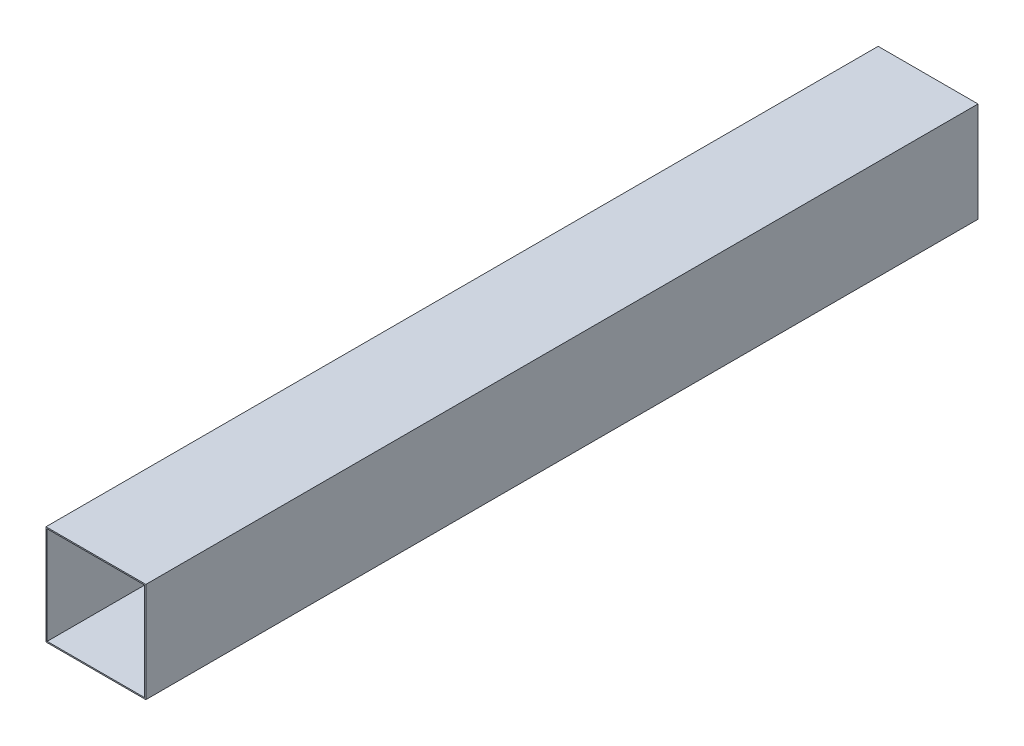
ISO-10303-21;
HEADER;
FILE_DESCRIPTION(('STEP AP214'),'2;1');
FILE_NAME('part.step','',(''),(''),'','','');
FILE_SCHEMA(('AUTOMOTIVE_DESIGN { 1 0 10303 214 1 1 1 1 }'));
ENDSEC;
DATA;
#1=APPLICATION_CONTEXT('core data for automotive mechanical design processes');
#2=APPLICATION_PROTOCOL_DEFINITION('international standard','automotive_design',2000,#1);
#3=PRODUCT_CONTEXT('',#1,'mechanical');
#4=PRODUCT('Part','Part','',(#3));
#5=PRODUCT_RELATED_PRODUCT_CATEGORY('part','',(#4));
#6=PRODUCT_DEFINITION_FORMATION('','',#4);
#7=PRODUCT_DEFINITION_CONTEXT('part definition',#1,'design');
#8=PRODUCT_DEFINITION('design','',#6,#7);
#9=PRODUCT_DEFINITION_SHAPE('','',#8);
#10=(LENGTH_UNIT() NAMED_UNIT(*) SI_UNIT(.MILLI.,.METRE.));
#11=(NAMED_UNIT(*) PLANE_ANGLE_UNIT() SI_UNIT($,.RADIAN.));
#12=(NAMED_UNIT(*) SI_UNIT($,.STERADIAN.) SOLID_ANGLE_UNIT());
#13=UNCERTAINTY_MEASURE_WITH_UNIT(LENGTH_MEASURE(1.E-05),#10,'distance_accuracy_value','');
#14=(GEOMETRIC_REPRESENTATION_CONTEXT(3) GLOBAL_UNCERTAINTY_ASSIGNED_CONTEXT((#13)) GLOBAL_UNIT_ASSIGNED_CONTEXT((#10,
#11,#12)) REPRESENTATION_CONTEXT('',''));
#15=CARTESIAN_POINT('',(0.,0.,0.));
#16=DIRECTION('',(0.,0.,1.));
#17=DIRECTION('',(1.,0.,0.));
#18=AXIS2_PLACEMENT_3D('',#15,#16,#17);
#19=CARTESIAN_POINT('',(38.1,-38.1,635.));
#20=DIRECTION('',(0.,-1.,0.));
#21=DIRECTION('',(1.,0.,0.));
#22=AXIS2_PLACEMENT_3D('',#19,#20,#21);
#23=PLANE('',#22);
#24=DIRECTION('',(-1.,0.,0.));
#25=VECTOR('',#24,1.);
#26=CARTESIAN_POINT('',(38.1,-38.1,0.));
#27=LINE('',#26,#25);
#28=CARTESIAN_POINT('',(38.1,-38.1,0.));
#29=VERTEX_POINT('',#28);
#30=CARTESIAN_POINT('',(-38.1,-38.1,0.));
#31=VERTEX_POINT('',#30);
#32=EDGE_CURVE('E157',#29,#31,#27,.T.);
#33=ORIENTED_EDGE('',*,*,#32,.F.);
#34=DIRECTION('',(0.,0.,-1.));
#35=VECTOR('',#34,1.);
#36=CARTESIAN_POINT('',(38.1,-38.1,635.));
#37=LINE('',#36,#35);
#38=CARTESIAN_POINT('',(38.1,-38.1,635.));
#39=VERTEX_POINT('',#38);
#40=EDGE_CURVE('E12',#39,#29,#37,.T.);
#41=ORIENTED_EDGE('',*,*,#40,.F.);
#42=DIRECTION('',(-1.,0.,0.));
#43=VECTOR('',#42,1.);
#44=CARTESIAN_POINT('',(38.1,-38.1,635.));
#45=LINE('',#44,#43);
#46=CARTESIAN_POINT('',(-38.1,-38.1,635.));
#47=VERTEX_POINT('',#46);
#48=EDGE_CURVE('E161',#39,#47,#45,.T.);
#49=ORIENTED_EDGE('',*,*,#48,.T.);
#50=DIRECTION('',(0.,0.,-1.));
#51=VECTOR('',#50,1.);
#52=CARTESIAN_POINT('',(-38.1,-38.1,635.));
#53=LINE('',#52,#51);
#54=EDGE_CURVE('E64',#47,#31,#53,.T.);
#55=ORIENTED_EDGE('',*,*,#54,.T.);
#56=EDGE_LOOP('',(#33,#41,#49,#55));
#57=FACE_BOUND('',#56,.T.);
#58=ADVANCED_FACE('F61',(#57),#23,.T.);
#59=CARTESIAN_POINT('',(38.1,-38.1,635.));
#60=DIRECTION('',(-1.,0.,0.));
#61=DIRECTION('',(0.,0.,1.));
#62=AXIS2_PLACEMENT_3D('',#59,#60,#61);
#63=PLANE('',#62);
#64=DIRECTION('',(0.,1.,0.));
#65=VECTOR('',#64,1.);
#66=CARTESIAN_POINT('',(38.1,-38.1,0.));
#67=LINE('',#66,#65);
#68=CARTESIAN_POINT('',(38.1,38.1,0.));
#69=VERTEX_POINT('',#68);
#70=EDGE_CURVE('E165',#29,#69,#67,.T.);
#71=ORIENTED_EDGE('',*,*,#70,.T.);
#72=DIRECTION('',(0.,0.,-1.));
#73=VECTOR('',#72,1.);
#74=CARTESIAN_POINT('',(38.1,38.1,635.));
#75=LINE('',#74,#73);
#76=CARTESIAN_POINT('',(38.1,38.1,635.));
#77=VERTEX_POINT('',#76);
#78=EDGE_CURVE('E69',#77,#69,#75,.T.);
#79=ORIENTED_EDGE('',*,*,#78,.F.);
#80=DIRECTION('',(0.,1.,0.));
#81=VECTOR('',#80,1.);
#82=CARTESIAN_POINT('',(38.1,-38.1,635.));
#83=LINE('',#82,#81);
#84=EDGE_CURVE('E170',#39,#77,#83,.T.);
#85=ORIENTED_EDGE('',*,*,#84,.F.);
#86=ORIENTED_EDGE('',*,*,#40,.T.);
#87=EDGE_LOOP('',(#71,#79,#85,#86));
#88=FACE_BOUND('',#87,.T.);
#89=ADVANCED_FACE('F197',(#88),#63,.F.);
#90=CARTESIAN_POINT('',(38.1,38.1,635.));
#91=DIRECTION('',(0.,-1.,0.));
#92=DIRECTION('',(1.,0.,0.));
#93=AXIS2_PLACEMENT_3D('',#90,#91,#92);
#94=PLANE('',#93);
#95=DIRECTION('',(-1.,0.,0.));
#96=VECTOR('',#95,1.);
#97=CARTESIAN_POINT('',(38.1,38.1,0.));
#98=LINE('',#97,#96);
#99=CARTESIAN_POINT('',(-38.1,38.1,0.));
#100=VERTEX_POINT('',#99);
#101=EDGE_CURVE('E177',#69,#100,#98,.T.);
#102=ORIENTED_EDGE('',*,*,#101,.T.);
#103=DIRECTION('',(0.,0.,-1.));
#104=VECTOR('',#103,1.);
#105=CARTESIAN_POINT('',(-38.1,38.1,635.));
#106=LINE('',#105,#104);
#107=CARTESIAN_POINT('',(-38.1,38.1,635.));
#108=VERTEX_POINT('',#107);
#109=EDGE_CURVE('E182',#108,#100,#106,.T.);
#110=ORIENTED_EDGE('',*,*,#109,.F.);
#111=DIRECTION('',(-1.,0.,0.));
#112=VECTOR('',#111,1.);
#113=CARTESIAN_POINT('',(38.1,38.1,635.));
#114=LINE('',#113,#112);
#115=EDGE_CURVE('E168',#77,#108,#114,.T.);
#116=ORIENTED_EDGE('',*,*,#115,.F.);
#117=ORIENTED_EDGE('',*,*,#78,.T.);
#118=EDGE_LOOP('',(#102,#110,#116,#117));
#119=FACE_BOUND('',#118,.T.);
#120=ADVANCED_FACE('F201',(#119),#94,.F.);
#121=CARTESIAN_POINT('',(-38.1,-38.1,635.));
#122=DIRECTION('',(-1.,0.,0.));
#123=DIRECTION('',(0.,0.,1.));
#124=AXIS2_PLACEMENT_3D('',#121,#122,#123);
#125=PLANE('',#124);
#126=DIRECTION('',(0.,1.,0.));
#127=VECTOR('',#126,1.);
#128=CARTESIAN_POINT('',(-38.1,-38.1,0.));
#129=LINE('',#128,#127);
#130=EDGE_CURVE('E174',#31,#100,#129,.T.);
#131=ORIENTED_EDGE('',*,*,#130,.F.);
#132=ORIENTED_EDGE('',*,*,#54,.F.);
#133=DIRECTION('',(0.,1.,0.));
#134=VECTOR('',#133,1.);
#135=CARTESIAN_POINT('',(-38.1,-38.1,635.));
#136=LINE('',#135,#134);
#137=EDGE_CURVE('E164',#47,#108,#136,.T.);
#138=ORIENTED_EDGE('',*,*,#137,.T.);
#139=ORIENTED_EDGE('',*,*,#109,.T.);
#140=EDGE_LOOP('',(#131,#132,#138,#139));
#141=FACE_BOUND('',#140,.T.);
#142=ADVANCED_FACE('F190',(#141),#125,.T.);
#143=CARTESIAN_POINT('',(0.,0.,635.));
#144=DIRECTION('',(0.,0.,-1.));
#145=DIRECTION('',(-1.,0.,0.));
#146=AXIS2_PLACEMENT_3D('',#143,#144,#145);
#147=PLANE('',#146);
#148=DIRECTION('',(0.,1.,0.));
#149=VECTOR('',#148,1.);
#150=CARTESIAN_POINT('',(37.1856,-37.1856,635.));
#151=LINE('',#150,#149);
#152=CARTESIAN_POINT('',(37.1856,-37.1856,635.));
#153=VERTEX_POINT('',#152);
#154=CARTESIAN_POINT('',(37.1856,37.1856,635.));
#155=VERTEX_POINT('',#154);
#156=EDGE_CURVE('E131',#153,#155,#151,.T.);
#157=ORIENTED_EDGE('',*,*,#156,.F.);
#158=DIRECTION('',(-1.,0.,0.));
#159=VECTOR('',#158,1.);
#160=CARTESIAN_POINT('',(37.1856,-37.1856,635.));
#161=LINE('',#160,#159);
#162=CARTESIAN_POINT('',(-37.1856,-37.1856,635.));
#163=VERTEX_POINT('',#162);
#164=EDGE_CURVE('E128',#153,#163,#161,.T.);
#165=ORIENTED_EDGE('',*,*,#164,.T.);
#166=DIRECTION('',(0.,1.,0.));
#167=VECTOR('',#166,1.);
#168=CARTESIAN_POINT('',(-37.1856,-37.1856,635.));
#169=LINE('',#168,#167);
#170=CARTESIAN_POINT('',(-37.1856,37.1856,635.));
#171=VERTEX_POINT('',#170);
#172=EDGE_CURVE('E134',#163,#171,#169,.T.);
#173=ORIENTED_EDGE('',*,*,#172,.T.);
#174=DIRECTION('',(-1.,0.,0.));
#175=VECTOR('',#174,1.);
#176=CARTESIAN_POINT('',(37.1856,37.1856,635.));
#177=LINE('',#176,#175);
#178=EDGE_CURVE('E138',#155,#171,#177,.T.);
#179=ORIENTED_EDGE('',*,*,#178,.F.);
#180=EDGE_LOOP('',(#157,#165,#173,#179));
#181=FACE_BOUND('',#180,.T.);
#182=ORIENTED_EDGE('',*,*,#48,.F.);
#183=ORIENTED_EDGE('',*,*,#84,.T.);
#184=ORIENTED_EDGE('',*,*,#115,.T.);
#185=ORIENTED_EDGE('',*,*,#137,.F.);
#186=EDGE_LOOP('',(#182,#183,#184,#185));
#187=FACE_BOUND('',#186,.T.);
#188=ADVANCED_FACE('F140',(#181,#187),#147,.F.);
#189=CARTESIAN_POINT('',(0.,0.,0.));
#190=DIRECTION('',(0.,0.,-1.));
#191=DIRECTION('',(-1.,0.,0.));
#192=AXIS2_PLACEMENT_3D('',#189,#190,#191);
#193=PLANE('',#192);
#194=DIRECTION('',(-1.,0.,0.));
#195=VECTOR('',#194,1.);
#196=CARTESIAN_POINT('',(37.1856,-37.1856,0.));
#197=LINE('',#196,#195);
#198=CARTESIAN_POINT('',(37.1856,-37.1856,0.));
#199=VERTEX_POINT('',#198);
#200=CARTESIAN_POINT('',(-37.1856,-37.1856,0.));
#201=VERTEX_POINT('',#200);
#202=EDGE_CURVE('E85',#199,#201,#197,.T.);
#203=ORIENTED_EDGE('',*,*,#202,.F.);
#204=DIRECTION('',(0.,1.,0.));
#205=VECTOR('',#204,1.);
#206=CARTESIAN_POINT('',(37.1856,-37.1856,0.));
#207=LINE('',#206,#205);
#208=CARTESIAN_POINT('',(37.1856,37.1856,0.));
#209=VERTEX_POINT('',#208);
#210=EDGE_CURVE('E142',#199,#209,#207,.T.);
#211=ORIENTED_EDGE('',*,*,#210,.T.);
#212=DIRECTION('',(-1.,0.,0.));
#213=VECTOR('',#212,1.);
#214=CARTESIAN_POINT('',(37.1856,37.1856,0.));
#215=LINE('',#214,#213);
#216=CARTESIAN_POINT('',(-37.1856,37.1856,0.));
#217=VERTEX_POINT('',#216);
#218=EDGE_CURVE('E145',#209,#217,#215,.T.);
#219=ORIENTED_EDGE('',*,*,#218,.T.);
#220=DIRECTION('',(0.,1.,0.));
#221=VECTOR('',#220,1.);
#222=CARTESIAN_POINT('',(-37.1856,-37.1856,0.));
#223=LINE('',#222,#221);
#224=EDGE_CURVE('E151',#201,#217,#223,.T.);
#225=ORIENTED_EDGE('',*,*,#224,.F.);
#226=EDGE_LOOP('',(#203,#211,#219,#225));
#227=FACE_BOUND('',#226,.T.);
#228=ORIENTED_EDGE('',*,*,#32,.T.);
#229=ORIENTED_EDGE('',*,*,#130,.T.);
#230=ORIENTED_EDGE('',*,*,#101,.F.);
#231=ORIENTED_EDGE('',*,*,#70,.F.);
#232=EDGE_LOOP('',(#228,#229,#230,#231));
#233=FACE_BOUND('',#232,.T.);
#234=ADVANCED_FACE('F194',(#227,#233),#193,.T.);
#235=CARTESIAN_POINT('',(37.1856,-37.1856,635.));
#236=DIRECTION('',(0.,-1.,0.));
#237=DIRECTION('',(0.,0.,-1.));
#238=AXIS2_PLACEMENT_3D('',#235,#236,#237);
#239=PLANE('',#238);
#240=ORIENTED_EDGE('',*,*,#202,.T.);
#241=DIRECTION('',(0.,0.,-1.));
#242=VECTOR('',#241,1.);
#243=CARTESIAN_POINT('',(-37.1856,-37.1856,635.));
#244=LINE('',#243,#242);
#245=EDGE_CURVE('E125',#163,#201,#244,.T.);
#246=ORIENTED_EDGE('',*,*,#245,.F.);
#247=ORIENTED_EDGE('',*,*,#164,.F.);
#248=DIRECTION('',(0.,0.,-1.));
#249=VECTOR('',#248,1.);
#250=CARTESIAN_POINT('',(37.1856,-37.1856,635.));
#251=LINE('',#250,#249);
#252=EDGE_CURVE('E155',#153,#199,#251,.T.);
#253=ORIENTED_EDGE('',*,*,#252,.T.);
#254=EDGE_LOOP('',(#240,#246,#247,#253));
#255=FACE_BOUND('',#254,.T.);
#256=ADVANCED_FACE('F126',(#255),#239,.F.);
#257=CARTESIAN_POINT('',(37.1856,-37.1856,635.));
#258=DIRECTION('',(-1.,0.,0.));
#259=DIRECTION('',(0.,0.,1.));
#260=AXIS2_PLACEMENT_3D('',#257,#258,#259);
#261=PLANE('',#260);
#262=ORIENTED_EDGE('',*,*,#210,.F.);
#263=ORIENTED_EDGE('',*,*,#252,.F.);
#264=ORIENTED_EDGE('',*,*,#156,.T.);
#265=DIRECTION('',(0.,0.,-1.));
#266=VECTOR('',#265,1.);
#267=CARTESIAN_POINT('',(37.1856,37.1856,635.));
#268=LINE('',#267,#266);
#269=EDGE_CURVE('E158',#155,#209,#268,.T.);
#270=ORIENTED_EDGE('',*,*,#269,.T.);
#271=EDGE_LOOP('',(#262,#263,#264,#270));
#272=FACE_BOUND('',#271,.T.);
#273=ADVANCED_FACE('F245',(#272),#261,.T.);
#274=CARTESIAN_POINT('',(37.1856,37.1856,635.));
#275=DIRECTION('',(0.,-1.,0.));
#276=DIRECTION('',(0.,0.,-1.));
#277=AXIS2_PLACEMENT_3D('',#274,#275,#276);
#278=PLANE('',#277);
#279=ORIENTED_EDGE('',*,*,#218,.F.);
#280=ORIENTED_EDGE('',*,*,#269,.F.);
#281=ORIENTED_EDGE('',*,*,#178,.T.);
#282=DIRECTION('',(0.,0.,-1.));
#283=VECTOR('',#282,1.);
#284=CARTESIAN_POINT('',(-37.1856,37.1856,635.));
#285=LINE('',#284,#283);
#286=EDGE_CURVE('E77',#171,#217,#285,.T.);
#287=ORIENTED_EDGE('',*,*,#286,.T.);
#288=EDGE_LOOP('',(#279,#280,#281,#287));
#289=FACE_BOUND('',#288,.T.);
#290=ADVANCED_FACE('F253',(#289),#278,.T.);
#291=CARTESIAN_POINT('',(-37.1856,-37.1856,635.));
#292=DIRECTION('',(-1.,0.,0.));
#293=DIRECTION('',(0.,0.,1.));
#294=AXIS2_PLACEMENT_3D('',#291,#292,#293);
#295=PLANE('',#294);
#296=ORIENTED_EDGE('',*,*,#224,.T.);
#297=ORIENTED_EDGE('',*,*,#286,.F.);
#298=ORIENTED_EDGE('',*,*,#172,.F.);
#299=ORIENTED_EDGE('',*,*,#245,.T.);
#300=EDGE_LOOP('',(#296,#297,#298,#299));
#301=FACE_BOUND('',#300,.T.);
#302=ADVANCED_FACE('F135',(#301),#295,.F.);
#303=CLOSED_SHELL('',(#58,#89,#120,#142,#188,#234,#256,#273,#290,#302));
#304=MANIFOLD_SOLID_BREP('B2',#303);
#305=ADVANCED_BREP_SHAPE_REPRESENTATION('',(#18,#304),#14);
#306=SHAPE_DEFINITION_REPRESENTATION(#9,#305);
ENDSEC;
END-ISO-10303-21;
